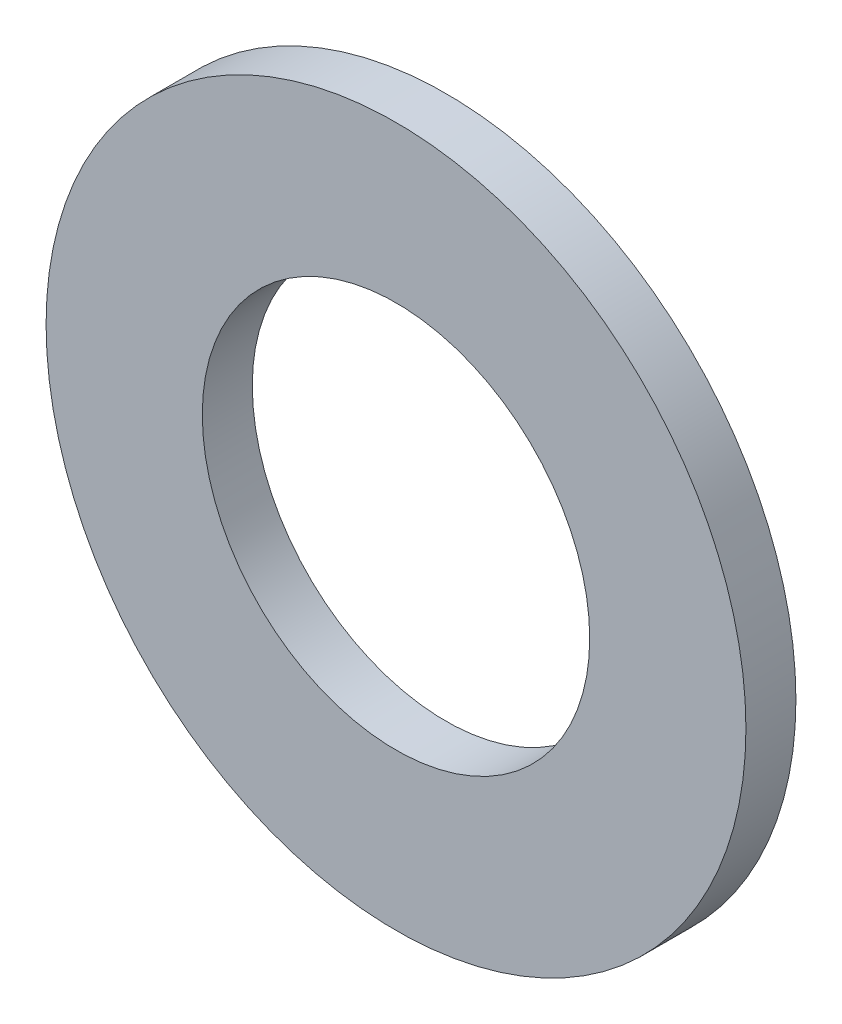
ISO-10303-21;
HEADER;
FILE_DESCRIPTION(('STEP AP214'),'2;1');
FILE_NAME('part.step','',(''),(''),'','','');
FILE_SCHEMA(('AUTOMOTIVE_DESIGN { 1 0 10303 214 1 1 1 1 }'));
ENDSEC;
DATA;
#1=APPLICATION_CONTEXT('core data for automotive mechanical design processes');
#2=APPLICATION_PROTOCOL_DEFINITION('international standard','automotive_design',2000,#1);
#3=PRODUCT_CONTEXT('',#1,'mechanical');
#4=PRODUCT('Part','Part','',(#3));
#5=PRODUCT_RELATED_PRODUCT_CATEGORY('part','',(#4));
#6=PRODUCT_DEFINITION_FORMATION('','',#4);
#7=PRODUCT_DEFINITION_CONTEXT('part definition',#1,'design');
#8=PRODUCT_DEFINITION('design','',#6,#7);
#9=PRODUCT_DEFINITION_SHAPE('','',#8);
#10=(LENGTH_UNIT() NAMED_UNIT(*) SI_UNIT(.MILLI.,.METRE.));
#11=(NAMED_UNIT(*) PLANE_ANGLE_UNIT() SI_UNIT($,.RADIAN.));
#12=(NAMED_UNIT(*) SI_UNIT($,.STERADIAN.) SOLID_ANGLE_UNIT());
#13=UNCERTAINTY_MEASURE_WITH_UNIT(LENGTH_MEASURE(1.E-05),#10,'distance_accuracy_value','');
#14=(GEOMETRIC_REPRESENTATION_CONTEXT(3) GLOBAL_UNCERTAINTY_ASSIGNED_CONTEXT((#13)) GLOBAL_UNIT_ASSIGNED_CONTEXT((#10,
#11,#12)) REPRESENTATION_CONTEXT('',''));
#15=CARTESIAN_POINT('',(0.,0.,0.));
#16=DIRECTION('',(0.,0.,1.));
#17=DIRECTION('',(1.,0.,0.));
#18=AXIS2_PLACEMENT_3D('',#15,#16,#17);
#19=CARTESIAN_POINT('',(0.,0.,4.));
#20=DIRECTION('',(0.,0.,1.));
#21=DIRECTION('',(1.,0.,0.));
#22=AXIS2_PLACEMENT_3D('',#19,#20,#21);
#23=PLANE('',#22);
#24=CARTESIAN_POINT('',(0.,0.,4.));
#25=DIRECTION('',(0.,0.,1.));
#26=DIRECTION('',(1.,0.,0.));
#27=AXIS2_PLACEMENT_3D('',#24,#25,#26);
#28=CIRCLE('',#27,28.);
#29=CARTESIAN_POINT('',(28.,0.,4.));
#30=VERTEX_POINT('',#29);
#31=EDGE_CURVE('E10',#30,#30,#28,.T.);
#32=ORIENTED_EDGE('',*,*,#31,.T.);
#33=EDGE_LOOP('',(#32));
#34=FACE_BOUND('',#33,.T.);
#35=CARTESIAN_POINT('',(0.,0.,4.));
#36=DIRECTION('',(0.,0.,1.));
#37=DIRECTION('',(1.,0.,0.));
#38=AXIS2_PLACEMENT_3D('',#35,#36,#37);
#39=CIRCLE('',#38,15.5);
#40=CARTESIAN_POINT('',(15.5,0.,4.));
#41=VERTEX_POINT('',#40);
#42=EDGE_CURVE('E43',#41,#41,#39,.T.);
#43=ORIENTED_EDGE('',*,*,#42,.F.);
#44=EDGE_LOOP('',(#43));
#45=FACE_BOUND('',#44,.T.);
#46=ADVANCED_FACE('F32',(#34,#45),#23,.T.);
#47=CARTESIAN_POINT('',(0.,0.,0.));
#48=DIRECTION('',(0.,0.,1.));
#49=DIRECTION('',(1.,0.,0.));
#50=AXIS2_PLACEMENT_3D('',#47,#48,#49);
#51=PLANE('',#50);
#52=CARTESIAN_POINT('',(0.,0.,0.));
#53=DIRECTION('',(0.,0.,1.));
#54=DIRECTION('',(1.,0.,0.));
#55=AXIS2_PLACEMENT_3D('',#52,#53,#54);
#56=CIRCLE('',#55,28.);
#57=CARTESIAN_POINT('',(28.,0.,0.));
#58=VERTEX_POINT('',#57);
#59=EDGE_CURVE('E36',#58,#58,#56,.T.);
#60=ORIENTED_EDGE('',*,*,#59,.F.);
#61=EDGE_LOOP('',(#60));
#62=FACE_BOUND('',#61,.T.);
#63=CARTESIAN_POINT('',(0.,0.,0.));
#64=DIRECTION('',(0.,0.,1.));
#65=DIRECTION('',(1.,0.,0.));
#66=AXIS2_PLACEMENT_3D('',#63,#64,#65);
#67=CIRCLE('',#66,15.5);
#68=CARTESIAN_POINT('',(15.5,0.,0.));
#69=VERTEX_POINT('',#68);
#70=EDGE_CURVE('E45',#69,#69,#67,.T.);
#71=ORIENTED_EDGE('',*,*,#70,.T.);
#72=EDGE_LOOP('',(#71));
#73=FACE_BOUND('',#72,.T.);
#74=ADVANCED_FACE('F55',(#62,#73),#51,.F.);
#75=CARTESIAN_POINT('',(0.,0.,4.));
#76=DIRECTION('',(0.,0.,-1.));
#77=DIRECTION('',(-1.,0.,0.));
#78=AXIS2_PLACEMENT_3D('',#75,#76,#77);
#79=CYLINDRICAL_SURFACE('',#78,28.);
#80=ORIENTED_EDGE('',*,*,#31,.F.);
#81=EDGE_LOOP('',(#80));
#82=FACE_BOUND('',#81,.T.);
#83=ORIENTED_EDGE('',*,*,#59,.T.);
#84=EDGE_LOOP('',(#83));
#85=FACE_BOUND('',#84,.T.);
#86=ADVANCED_FACE('F34',(#82,#85),#79,.T.);
#87=CARTESIAN_POINT('',(0.,0.,4.));
#88=DIRECTION('',(0.,0.,-1.));
#89=DIRECTION('',(-1.,0.,0.));
#90=AXIS2_PLACEMENT_3D('',#87,#88,#89);
#91=CYLINDRICAL_SURFACE('',#90,15.5);
#92=ORIENTED_EDGE('',*,*,#42,.T.);
#93=EDGE_LOOP('',(#92));
#94=FACE_BOUND('',#93,.T.);
#95=ORIENTED_EDGE('',*,*,#70,.F.);
#96=EDGE_LOOP('',(#95));
#97=FACE_BOUND('',#96,.T.);
#98=ADVANCED_FACE('F51',(#94,#97),#91,.F.);
#99=CLOSED_SHELL('',(#46,#74,#86,#98));
#100=MANIFOLD_SOLID_BREP('B2',#99);
#101=ADVANCED_BREP_SHAPE_REPRESENTATION('',(#18,#100),#14);
#102=SHAPE_DEFINITION_REPRESENTATION(#9,#101);
ENDSEC;
END-ISO-10303-21;
